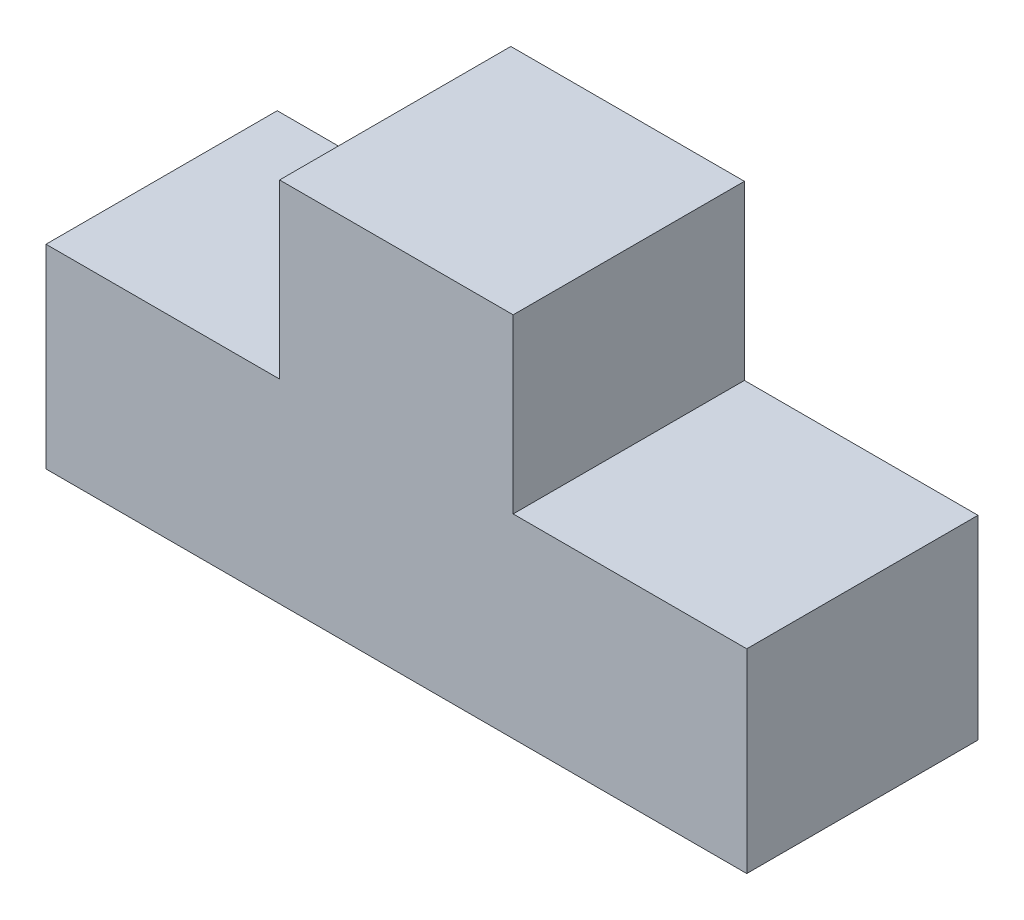
ISO-10303-21;
HEADER;
FILE_DESCRIPTION(('STEP AP214'),'2;1');
FILE_NAME('part.step','',(''),(''),'','','');
FILE_SCHEMA(('AUTOMOTIVE_DESIGN { 1 0 10303 214 1 1 1 1 }'));
ENDSEC;
DATA;
#1=APPLICATION_CONTEXT('core data for automotive mechanical design processes');
#2=APPLICATION_PROTOCOL_DEFINITION('international standard','automotive_design',2000,#1);
#3=PRODUCT_CONTEXT('',#1,'mechanical');
#4=PRODUCT('Part','Part','',(#3));
#5=PRODUCT_RELATED_PRODUCT_CATEGORY('part','',(#4));
#6=PRODUCT_DEFINITION_FORMATION('','',#4);
#7=PRODUCT_DEFINITION_CONTEXT('part definition',#1,'design');
#8=PRODUCT_DEFINITION('design','',#6,#7);
#9=PRODUCT_DEFINITION_SHAPE('','',#8);
#10=(LENGTH_UNIT() NAMED_UNIT(*) SI_UNIT(.MILLI.,.METRE.));
#11=(NAMED_UNIT(*) PLANE_ANGLE_UNIT() SI_UNIT($,.RADIAN.));
#12=(NAMED_UNIT(*) SI_UNIT($,.STERADIAN.) SOLID_ANGLE_UNIT());
#13=UNCERTAINTY_MEASURE_WITH_UNIT(LENGTH_MEASURE(1.E-05),#10,'distance_accuracy_value','');
#14=(GEOMETRIC_REPRESENTATION_CONTEXT(3) GLOBAL_UNCERTAINTY_ASSIGNED_CONTEXT((#13)) GLOBAL_UNIT_ASSIGNED_CONTEXT((#10,
#11,#12)) REPRESENTATION_CONTEXT('',''));
#15=CARTESIAN_POINT('',(0.,0.,0.));
#16=DIRECTION('',(0.,0.,1.));
#17=DIRECTION('',(1.,0.,0.));
#18=AXIS2_PLACEMENT_3D('',#15,#16,#17);
#19=CARTESIAN_POINT('',(0.,635.,754.38));
#20=DIRECTION('',(1.,0.,0.));
#21=DIRECTION('',(0.,1.,0.));
#22=AXIS2_PLACEMENT_3D('',#19,#20,#21);
#23=PLANE('',#22);
#24=DIRECTION('',(0.,-1.,0.));
#25=VECTOR('',#24,1.);
#26=CARTESIAN_POINT('',(0.,635.,0.));
#27=LINE('',#26,#25);
#28=CARTESIAN_POINT('',(0.,635.,0.));
#29=VERTEX_POINT('',#28);
#30=CARTESIAN_POINT('',(0.,0.,0.));
#31=VERTEX_POINT('',#30);
#32=EDGE_CURVE('E129',#29,#31,#27,.T.);
#33=ORIENTED_EDGE('',*,*,#32,.T.);
#34=DIRECTION('',(0.,0.,-1.));
#35=VECTOR('',#34,1.);
#36=CARTESIAN_POINT('',(0.,0.,754.38));
#37=LINE('',#36,#35);
#38=CARTESIAN_POINT('',(0.,0.,754.38));
#39=VERTEX_POINT('',#38);
#40=EDGE_CURVE('E11',#39,#31,#37,.T.);
#41=ORIENTED_EDGE('',*,*,#40,.F.);
#42=DIRECTION('',(0.,-1.,0.));
#43=VECTOR('',#42,1.);
#44=CARTESIAN_POINT('',(0.,635.,754.38));
#45=LINE('',#44,#43);
#46=CARTESIAN_POINT('',(0.,635.,754.38));
#47=VERTEX_POINT('',#46);
#48=EDGE_CURVE('E143',#47,#39,#45,.T.);
#49=ORIENTED_EDGE('',*,*,#48,.F.);
#50=DIRECTION('',(0.,0.,-1.));
#51=VECTOR('',#50,1.);
#52=CARTESIAN_POINT('',(0.,635.,754.38));
#53=LINE('',#52,#51);
#54=EDGE_CURVE('E125',#47,#29,#53,.T.);
#55=ORIENTED_EDGE('',*,*,#54,.T.);
#56=EDGE_LOOP('',(#33,#41,#49,#55));
#57=FACE_BOUND('',#56,.T.);
#58=ADVANCED_FACE('F33',(#57),#23,.F.);
#59=CARTESIAN_POINT('',(0.,0.,754.38));
#60=DIRECTION('',(0.,1.,0.));
#61=DIRECTION('',(0.,0.,1.));
#62=AXIS2_PLACEMENT_3D('',#59,#60,#61);
#63=PLANE('',#62);
#64=DIRECTION('',(1.,0.,0.));
#65=VECTOR('',#64,1.);
#66=CARTESIAN_POINT('',(0.,0.,0.));
#67=LINE('',#66,#65);
#68=CARTESIAN_POINT('',(2286.,0.,0.));
#69=VERTEX_POINT('',#68);
#70=EDGE_CURVE('E132',#31,#69,#67,.T.);
#71=ORIENTED_EDGE('',*,*,#70,.T.);
#72=DIRECTION('',(0.,0.,-1.));
#73=VECTOR('',#72,1.);
#74=CARTESIAN_POINT('',(2286.,0.,754.38));
#75=LINE('',#74,#73);
#76=CARTESIAN_POINT('',(2286.,0.,754.38));
#77=VERTEX_POINT('',#76);
#78=EDGE_CURVE('E41',#77,#69,#75,.T.);
#79=ORIENTED_EDGE('',*,*,#78,.F.);
#80=DIRECTION('',(1.,0.,0.));
#81=VECTOR('',#80,1.);
#82=CARTESIAN_POINT('',(0.,0.,754.38));
#83=LINE('',#82,#81);
#84=EDGE_CURVE('E92',#39,#77,#83,.T.);
#85=ORIENTED_EDGE('',*,*,#84,.F.);
#86=ORIENTED_EDGE('',*,*,#40,.T.);
#87=EDGE_LOOP('',(#71,#79,#85,#86));
#88=FACE_BOUND('',#87,.T.);
#89=ADVANCED_FACE('F178',(#88),#63,.F.);
#90=CARTESIAN_POINT('',(2286.,0.,754.38));
#91=DIRECTION('',(-1.,0.,0.));
#92=DIRECTION('',(0.,0.,1.));
#93=AXIS2_PLACEMENT_3D('',#90,#91,#92);
#94=PLANE('',#93);
#95=DIRECTION('',(0.,1.,0.));
#96=VECTOR('',#95,1.);
#97=CARTESIAN_POINT('',(2286.,0.,0.));
#98=LINE('',#97,#96);
#99=CARTESIAN_POINT('',(2286.,635.,0.));
#100=VERTEX_POINT('',#99);
#101=EDGE_CURVE('E134',#69,#100,#98,.T.);
#102=ORIENTED_EDGE('',*,*,#101,.T.);
#103=DIRECTION('',(0.,0.,-1.));
#104=VECTOR('',#103,1.);
#105=CARTESIAN_POINT('',(2286.,635.,754.38));
#106=LINE('',#105,#104);
#107=CARTESIAN_POINT('',(2286.,635.,754.38));
#108=VERTEX_POINT('',#107);
#109=EDGE_CURVE('E150',#108,#100,#106,.T.);
#110=ORIENTED_EDGE('',*,*,#109,.F.);
#111=DIRECTION('',(0.,1.,0.));
#112=VECTOR('',#111,1.);
#113=CARTESIAN_POINT('',(2286.,0.,754.38));
#114=LINE('',#113,#112);
#115=EDGE_CURVE('E158',#77,#108,#114,.T.);
#116=ORIENTED_EDGE('',*,*,#115,.F.);
#117=ORIENTED_EDGE('',*,*,#78,.T.);
#118=EDGE_LOOP('',(#102,#110,#116,#117));
#119=FACE_BOUND('',#118,.T.);
#120=ADVANCED_FACE('F156',(#119),#94,.F.);
#121=CARTESIAN_POINT('',(2286.,635.,754.38));
#122=DIRECTION('',(0.,-1.,0.));
#123=DIRECTION('',(1.,0.,0.));
#124=AXIS2_PLACEMENT_3D('',#121,#122,#123);
#125=PLANE('',#124);
#126=DIRECTION('',(-1.,0.,0.));
#127=VECTOR('',#126,1.);
#128=CARTESIAN_POINT('',(2286.,635.,0.));
#129=LINE('',#128,#127);
#130=CARTESIAN_POINT('',(1524.,635.,0.));
#131=VERTEX_POINT('',#130);
#132=EDGE_CURVE('E136',#100,#131,#129,.T.);
#133=ORIENTED_EDGE('',*,*,#132,.T.);
#134=DIRECTION('',(0.,0.,-1.));
#135=VECTOR('',#134,1.);
#136=CARTESIAN_POINT('',(1524.,635.,754.38));
#137=LINE('',#136,#135);
#138=CARTESIAN_POINT('',(1524.,635.,754.38));
#139=VERTEX_POINT('',#138);
#140=EDGE_CURVE('E147',#139,#131,#137,.T.);
#141=ORIENTED_EDGE('',*,*,#140,.F.);
#142=DIRECTION('',(-1.,0.,0.));
#143=VECTOR('',#142,1.);
#144=CARTESIAN_POINT('',(2286.,635.,754.38));
#145=LINE('',#144,#143);
#146=EDGE_CURVE('E170',#108,#139,#145,.T.);
#147=ORIENTED_EDGE('',*,*,#146,.F.);
#148=ORIENTED_EDGE('',*,*,#109,.T.);
#149=EDGE_LOOP('',(#133,#141,#147,#148));
#150=FACE_BOUND('',#149,.T.);
#151=ADVANCED_FACE('F166',(#150),#125,.F.);
#152=CARTESIAN_POINT('',(1524.,635.,754.38));
#153=DIRECTION('',(-1.,0.,0.));
#154=DIRECTION('',(0.,0.,1.));
#155=AXIS2_PLACEMENT_3D('',#152,#153,#154);
#156=PLANE('',#155);
#157=DIRECTION('',(0.,1.,0.));
#158=VECTOR('',#157,1.);
#159=CARTESIAN_POINT('',(1524.,635.,0.));
#160=LINE('',#159,#158);
#161=CARTESIAN_POINT('',(1524.,1197.58572624946,0.));
#162=VERTEX_POINT('',#161);
#163=EDGE_CURVE('E138',#131,#162,#160,.T.);
#164=ORIENTED_EDGE('',*,*,#163,.T.);
#165=DIRECTION('',(0.,0.,-1.));
#166=VECTOR('',#165,1.);
#167=CARTESIAN_POINT('',(1524.,1197.58572624946,754.38));
#168=LINE('',#167,#166);
#169=CARTESIAN_POINT('',(1524.,1197.58572624946,754.38));
#170=VERTEX_POINT('',#169);
#171=EDGE_CURVE('E120',#170,#162,#168,.T.);
#172=ORIENTED_EDGE('',*,*,#171,.F.);
#173=DIRECTION('',(0.,1.,0.));
#174=VECTOR('',#173,1.);
#175=CARTESIAN_POINT('',(1524.,635.,754.38));
#176=LINE('',#175,#174);
#177=EDGE_CURVE('E111',#139,#170,#176,.T.);
#178=ORIENTED_EDGE('',*,*,#177,.F.);
#179=ORIENTED_EDGE('',*,*,#140,.T.);
#180=EDGE_LOOP('',(#164,#172,#178,#179));
#181=FACE_BOUND('',#180,.T.);
#182=ADVANCED_FACE('F169',(#181),#156,.F.);
#183=CARTESIAN_POINT('',(1524.,1197.58572624946,754.38));
#184=DIRECTION('',(0.,-1.,0.));
#185=DIRECTION('',(0.,0.,-1.));
#186=AXIS2_PLACEMENT_3D('',#183,#184,#185);
#187=PLANE('',#186);
#188=DIRECTION('',(-1.,0.,0.));
#189=VECTOR('',#188,1.);
#190=CARTESIAN_POINT('',(1524.,1197.58572624946,0.));
#191=LINE('',#190,#189);
#192=CARTESIAN_POINT('',(762.,1197.58572624946,0.));
#193=VERTEX_POINT('',#192);
#194=EDGE_CURVE('E119',#162,#193,#191,.T.);
#195=ORIENTED_EDGE('',*,*,#194,.T.);
#196=DIRECTION('',(0.,0.,-1.));
#197=VECTOR('',#196,1.);
#198=CARTESIAN_POINT('',(762.,1197.58572624946,754.38));
#199=LINE('',#198,#197);
#200=CARTESIAN_POINT('',(762.,1197.58572624946,754.38));
#201=VERTEX_POINT('',#200);
#202=EDGE_CURVE('E116',#201,#193,#199,.T.);
#203=ORIENTED_EDGE('',*,*,#202,.F.);
#204=DIRECTION('',(-1.,0.,0.));
#205=VECTOR('',#204,1.);
#206=CARTESIAN_POINT('',(1524.,1197.58572624946,754.38));
#207=LINE('',#206,#205);
#208=EDGE_CURVE('E105',#170,#201,#207,.T.);
#209=ORIENTED_EDGE('',*,*,#208,.F.);
#210=ORIENTED_EDGE('',*,*,#171,.T.);
#211=EDGE_LOOP('',(#195,#203,#209,#210));
#212=FACE_BOUND('',#211,.T.);
#213=ADVANCED_FACE('F117',(#212),#187,.F.);
#214=CARTESIAN_POINT('',(762.,1197.58572624946,754.38));
#215=DIRECTION('',(1.,0.,0.));
#216=DIRECTION('',(0.,1.,0.));
#217=AXIS2_PLACEMENT_3D('',#214,#215,#216);
#218=PLANE('',#217);
#219=DIRECTION('',(0.,-1.,0.));
#220=VECTOR('',#219,1.);
#221=CARTESIAN_POINT('',(762.,1197.58572624946,0.));
#222=LINE('',#221,#220);
#223=CARTESIAN_POINT('',(762.,635.,0.));
#224=VERTEX_POINT('',#223);
#225=EDGE_CURVE('E78',#193,#224,#222,.T.);
#226=ORIENTED_EDGE('',*,*,#225,.T.);
#227=DIRECTION('',(0.,0.,-1.));
#228=VECTOR('',#227,1.);
#229=CARTESIAN_POINT('',(762.,635.,754.38));
#230=LINE('',#229,#228);
#231=CARTESIAN_POINT('',(762.,635.,754.38));
#232=VERTEX_POINT('',#231);
#233=EDGE_CURVE('E121',#232,#224,#230,.T.);
#234=ORIENTED_EDGE('',*,*,#233,.F.);
#235=DIRECTION('',(0.,-1.,0.));
#236=VECTOR('',#235,1.);
#237=CARTESIAN_POINT('',(762.,1197.58572624946,754.38));
#238=LINE('',#237,#236);
#239=EDGE_CURVE('E109',#201,#232,#238,.T.);
#240=ORIENTED_EDGE('',*,*,#239,.F.);
#241=ORIENTED_EDGE('',*,*,#202,.T.);
#242=EDGE_LOOP('',(#226,#234,#240,#241));
#243=FACE_BOUND('',#242,.T.);
#244=ADVANCED_FACE('F123',(#243),#218,.F.);
#245=CARTESIAN_POINT('',(762.,635.,754.38));
#246=DIRECTION('',(0.,-1.,0.));
#247=DIRECTION('',(0.,0.,-1.));
#248=AXIS2_PLACEMENT_3D('',#245,#246,#247);
#249=PLANE('',#248);
#250=DIRECTION('',(-1.,0.,0.));
#251=VECTOR('',#250,1.);
#252=CARTESIAN_POINT('',(762.,635.,0.));
#253=LINE('',#252,#251);
#254=EDGE_CURVE('E84',#224,#29,#253,.T.);
#255=ORIENTED_EDGE('',*,*,#254,.T.);
#256=ORIENTED_EDGE('',*,*,#54,.F.);
#257=DIRECTION('',(-1.,0.,0.));
#258=VECTOR('',#257,1.);
#259=CARTESIAN_POINT('',(762.,635.,754.38));
#260=LINE('',#259,#258);
#261=EDGE_CURVE('E49',#232,#47,#260,.T.);
#262=ORIENTED_EDGE('',*,*,#261,.F.);
#263=ORIENTED_EDGE('',*,*,#233,.T.);
#264=EDGE_LOOP('',(#255,#256,#262,#263));
#265=FACE_BOUND('',#264,.T.);
#266=ADVANCED_FACE('F194',(#265),#249,.F.);
#267=CARTESIAN_POINT('',(0.,0.,754.38));
#268=DIRECTION('',(0.,0.,1.));
#269=DIRECTION('',(1.,0.,0.));
#270=AXIS2_PLACEMENT_3D('',#267,#268,#269);
#271=PLANE('',#270);
#272=ORIENTED_EDGE('',*,*,#48,.T.);
#273=ORIENTED_EDGE('',*,*,#84,.T.);
#274=ORIENTED_EDGE('',*,*,#115,.T.);
#275=ORIENTED_EDGE('',*,*,#146,.T.);
#276=ORIENTED_EDGE('',*,*,#177,.T.);
#277=ORIENTED_EDGE('',*,*,#208,.T.);
#278=ORIENTED_EDGE('',*,*,#239,.T.);
#279=ORIENTED_EDGE('',*,*,#261,.T.);
#280=EDGE_LOOP('',(#272,#273,#274,#275,#276,#277,#278,#279));
#281=FACE_BOUND('',#280,.T.);
#282=ADVANCED_FACE('F107',(#281),#271,.T.);
#283=CARTESIAN_POINT('',(0.,0.,0.));
#284=DIRECTION('',(0.,0.,1.));
#285=DIRECTION('',(1.,0.,0.));
#286=AXIS2_PLACEMENT_3D('',#283,#284,#285);
#287=PLANE('',#286);
#288=ORIENTED_EDGE('',*,*,#32,.F.);
#289=ORIENTED_EDGE('',*,*,#254,.F.);
#290=ORIENTED_EDGE('',*,*,#225,.F.);
#291=ORIENTED_EDGE('',*,*,#194,.F.);
#292=ORIENTED_EDGE('',*,*,#163,.F.);
#293=ORIENTED_EDGE('',*,*,#132,.F.);
#294=ORIENTED_EDGE('',*,*,#101,.F.);
#295=ORIENTED_EDGE('',*,*,#70,.F.);
#296=EDGE_LOOP('',(#288,#289,#290,#291,#292,#293,#294,#295));
#297=FACE_BOUND('',#296,.T.);
#298=ADVANCED_FACE('F162',(#297),#287,.F.);
#299=CLOSED_SHELL('',(#58,#89,#120,#151,#182,#213,#244,#266,#282,#298));
#300=MANIFOLD_SOLID_BREP('B2',#299);
#301=ADVANCED_BREP_SHAPE_REPRESENTATION('',(#18,#300),#14);
#302=SHAPE_DEFINITION_REPRESENTATION(#9,#301);
ENDSEC;
END-ISO-10303-21;
